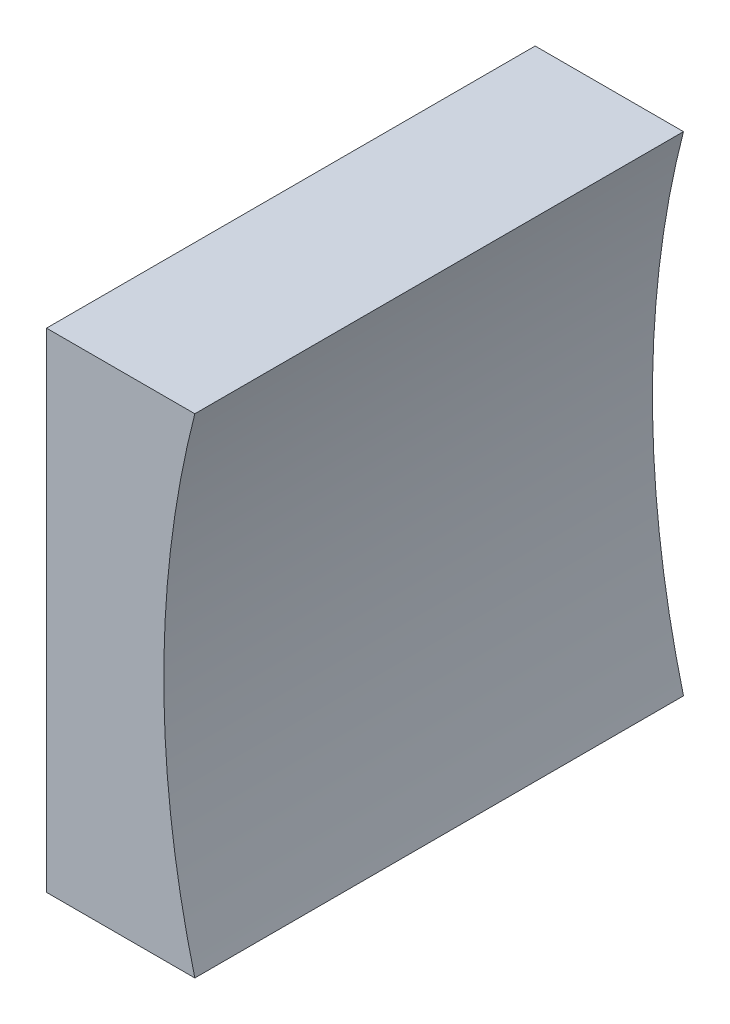
ISO-10303-21;
HEADER;
FILE_DESCRIPTION(('STEP AP214'),'2;1');
FILE_NAME('part.step','',(''),(''),'','','');
FILE_SCHEMA(('AUTOMOTIVE_DESIGN { 1 0 10303 214 1 1 1 1 }'));
ENDSEC;
DATA;
#1=APPLICATION_CONTEXT('core data for automotive mechanical design processes');
#2=APPLICATION_PROTOCOL_DEFINITION('international standard','automotive_design',2000,#1);
#3=PRODUCT_CONTEXT('',#1,'mechanical');
#4=PRODUCT('Part','Part','',(#3));
#5=PRODUCT_RELATED_PRODUCT_CATEGORY('part','',(#4));
#6=PRODUCT_DEFINITION_FORMATION('','',#4);
#7=PRODUCT_DEFINITION_CONTEXT('part definition',#1,'design');
#8=PRODUCT_DEFINITION('design','',#6,#7);
#9=PRODUCT_DEFINITION_SHAPE('','',#8);
#10=(LENGTH_UNIT() NAMED_UNIT(*) SI_UNIT(.MILLI.,.METRE.));
#11=(NAMED_UNIT(*) PLANE_ANGLE_UNIT() SI_UNIT($,.RADIAN.));
#12=(NAMED_UNIT(*) SI_UNIT($,.STERADIAN.) SOLID_ANGLE_UNIT());
#13=UNCERTAINTY_MEASURE_WITH_UNIT(LENGTH_MEASURE(1.E-05),#10,'distance_accuracy_value','');
#14=(GEOMETRIC_REPRESENTATION_CONTEXT(3) GLOBAL_UNCERTAINTY_ASSIGNED_CONTEXT((#13)) GLOBAL_UNIT_ASSIGNED_CONTEXT((#10,
#11,#12)) REPRESENTATION_CONTEXT('',''));
#15=CARTESIAN_POINT('',(0.,0.,0.));
#16=DIRECTION('',(0.,0.,1.));
#17=DIRECTION('',(1.,0.,0.));
#18=AXIS2_PLACEMENT_3D('',#15,#16,#17);
#19=CARTESIAN_POINT('',(146.147421901845,27.1789646338835,12.5));
#20=DIRECTION('',(0.,1.,0.));
#21=DIRECTION('',(-1.,0.,0.));
#22=AXIS2_PLACEMENT_3D('',#19,#20,#21);
#23=PLANE('',#22);
#24=DIRECTION('',(1.,0.,0.));
#25=VECTOR('',#24,1.);
#26=CARTESIAN_POINT('',(146.147421901845,27.1789646338835,0.));
#27=LINE('',#26,#25);
#28=CARTESIAN_POINT('',(142.353567815641,27.1789646338835,0.));
#29=VERTEX_POINT('',#28);
#30=CARTESIAN_POINT('',(146.147421901845,27.1789646338836,0.));
#31=VERTEX_POINT('',#30);
#32=EDGE_CURVE('E91',#29,#31,#27,.T.);
#33=ORIENTED_EDGE('',*,*,#32,.T.);
#34=DIRECTION('',(0.,0.,-1.));
#35=VECTOR('',#34,1.);
#36=CARTESIAN_POINT('',(146.147421901845,27.1789646338836,12.5));
#37=LINE('',#36,#35);
#38=CARTESIAN_POINT('',(146.147421901845,27.1789646338836,12.5));
#39=VERTEX_POINT('',#38);
#40=EDGE_CURVE('E45',#39,#31,#37,.T.);
#41=ORIENTED_EDGE('',*,*,#40,.F.);
#42=DIRECTION('',(1.,0.,0.));
#43=VECTOR('',#42,1.);
#44=CARTESIAN_POINT('',(146.147421901845,27.1789646338835,12.5));
#45=LINE('',#44,#43);
#46=CARTESIAN_POINT('',(142.353567815641,27.1789646338835,12.5));
#47=VERTEX_POINT('',#46);
#48=EDGE_CURVE('E84',#47,#39,#45,.T.);
#49=ORIENTED_EDGE('',*,*,#48,.F.);
#50=DIRECTION('',(0.,0.,-1.));
#51=VECTOR('',#50,1.);
#52=CARTESIAN_POINT('',(142.353567815641,27.1789646338835,12.5));
#53=LINE('',#52,#51);
#54=EDGE_CURVE('E11',#47,#29,#53,.T.);
#55=ORIENTED_EDGE('',*,*,#54,.T.);
#56=EDGE_LOOP('',(#33,#41,#49,#55));
#57=FACE_BOUND('',#56,.T.);
#58=ADVANCED_FACE('F37',(#57),#23,.F.);
#59=CARTESIAN_POINT('',(170.353567815641,33.4289646338835,12.5));
#60=DIRECTION('',(0.,0.,-1.));
#61=DIRECTION('',(-1.,0.,0.));
#62=AXIS2_PLACEMENT_3D('',#59,#60,#61);
#63=CYLINDRICAL_SURFACE('',#62,25.);
#64=CARTESIAN_POINT('',(170.353567815641,33.4289646338835,0.));
#65=DIRECTION('',(0.,0.,-1.));
#66=DIRECTION('',(1.,0.,0.));
#67=AXIS2_PLACEMENT_3D('',#64,#65,#66);
#68=CIRCLE('',#67,25.);
#69=CARTESIAN_POINT('',(146.147421901845,39.6789646338835,0.));
#70=VERTEX_POINT('',#69);
#71=EDGE_CURVE('E71',#31,#70,#68,.T.);
#72=ORIENTED_EDGE('',*,*,#71,.T.);
#73=DIRECTION('',(0.,0.,-1.));
#74=VECTOR('',#73,1.);
#75=CARTESIAN_POINT('',(146.147421901845,39.6789646338835,12.5));
#76=LINE('',#75,#74);
#77=CARTESIAN_POINT('',(146.147421901845,39.6789646338835,12.5));
#78=VERTEX_POINT('',#77);
#79=EDGE_CURVE('E92',#78,#70,#76,.T.);
#80=ORIENTED_EDGE('',*,*,#79,.F.);
#81=CARTESIAN_POINT('',(170.353567815641,33.4289646338835,12.5));
#82=DIRECTION('',(0.,0.,-1.));
#83=DIRECTION('',(1.,0.,0.));
#84=AXIS2_PLACEMENT_3D('',#81,#82,#83);
#85=CIRCLE('',#84,25.);
#86=EDGE_CURVE('E88',#39,#78,#85,.T.);
#87=ORIENTED_EDGE('',*,*,#86,.F.);
#88=ORIENTED_EDGE('',*,*,#40,.T.);
#89=EDGE_LOOP('',(#72,#80,#87,#88));
#90=FACE_BOUND('',#89,.T.);
#91=ADVANCED_FACE('F93',(#90),#63,.F.);
#92=CARTESIAN_POINT('',(142.353567815641,39.6789646338835,12.5));
#93=DIRECTION('',(0.,-1.,0.));
#94=DIRECTION('',(0.,0.,-1.));
#95=AXIS2_PLACEMENT_3D('',#92,#93,#94);
#96=PLANE('',#95);
#97=DIRECTION('',(-1.,0.,0.));
#98=VECTOR('',#97,1.);
#99=CARTESIAN_POINT('',(142.353567815641,39.6789646338835,0.));
#100=LINE('',#99,#98);
#101=CARTESIAN_POINT('',(142.353567815641,39.6789646338835,0.));
#102=VERTEX_POINT('',#101);
#103=EDGE_CURVE('E78',#70,#102,#100,.T.);
#104=ORIENTED_EDGE('',*,*,#103,.T.);
#105=DIRECTION('',(0.,0.,-1.));
#106=VECTOR('',#105,1.);
#107=CARTESIAN_POINT('',(142.353567815641,39.6789646338835,12.5));
#108=LINE('',#107,#106);
#109=CARTESIAN_POINT('',(142.353567815641,39.6789646338835,12.5));
#110=VERTEX_POINT('',#109);
#111=EDGE_CURVE('E97',#110,#102,#108,.T.);
#112=ORIENTED_EDGE('',*,*,#111,.F.);
#113=DIRECTION('',(-1.,0.,0.));
#114=VECTOR('',#113,1.);
#115=CARTESIAN_POINT('',(142.353567815641,39.6789646338835,12.5));
#116=LINE('',#115,#114);
#117=EDGE_CURVE('E95',#78,#110,#116,.T.);
#118=ORIENTED_EDGE('',*,*,#117,.F.);
#119=ORIENTED_EDGE('',*,*,#79,.T.);
#120=EDGE_LOOP('',(#104,#112,#118,#119));
#121=FACE_BOUND('',#120,.T.);
#122=ADVANCED_FACE('F107',(#121),#96,.F.);
#123=CARTESIAN_POINT('',(142.353567815641,33.4289646338835,12.5));
#124=DIRECTION('',(1.,0.,0.));
#125=DIRECTION('',(0.,0.,-1.));
#126=AXIS2_PLACEMENT_3D('',#123,#124,#125);
#127=PLANE('',#126);
#128=DIRECTION('',(0.,-1.,0.));
#129=VECTOR('',#128,1.);
#130=CARTESIAN_POINT('',(142.353567815641,33.4289646338835,0.));
#131=LINE('',#130,#129);
#132=EDGE_CURVE('E104',#102,#29,#131,.T.);
#133=ORIENTED_EDGE('',*,*,#132,.T.);
#134=ORIENTED_EDGE('',*,*,#54,.F.);
#135=DIRECTION('',(0.,-1.,0.));
#136=VECTOR('',#135,1.);
#137=CARTESIAN_POINT('',(142.353567815641,27.1789646338835,12.5));
#138=LINE('',#137,#136);
#139=EDGE_CURVE('E53',#110,#47,#138,.T.);
#140=ORIENTED_EDGE('',*,*,#139,.F.);
#141=ORIENTED_EDGE('',*,*,#111,.T.);
#142=EDGE_LOOP('',(#133,#134,#140,#141));
#143=FACE_BOUND('',#142,.T.);
#144=ADVANCED_FACE('F111',(#143),#127,.F.);
#145=CARTESIAN_POINT('',(170.353567815641,33.4289646338835,12.5));
#146=DIRECTION('',(0.,0.,1.));
#147=DIRECTION('',(1.,0.,0.));
#148=AXIS2_PLACEMENT_3D('',#145,#146,#147);
#149=PLANE('',#148);
#150=ORIENTED_EDGE('',*,*,#139,.T.);
#151=ORIENTED_EDGE('',*,*,#48,.T.);
#152=ORIENTED_EDGE('',*,*,#86,.T.);
#153=ORIENTED_EDGE('',*,*,#117,.T.);
#154=EDGE_LOOP('',(#150,#151,#152,#153));
#155=FACE_BOUND('',#154,.T.);
#156=ADVANCED_FACE('F86',(#155),#149,.T.);
#157=CARTESIAN_POINT('',(170.353567815641,33.4289646338835,0.));
#158=DIRECTION('',(0.,0.,1.));
#159=DIRECTION('',(1.,0.,0.));
#160=AXIS2_PLACEMENT_3D('',#157,#158,#159);
#161=PLANE('',#160);
#162=ORIENTED_EDGE('',*,*,#32,.F.);
#163=ORIENTED_EDGE('',*,*,#132,.F.);
#164=ORIENTED_EDGE('',*,*,#103,.F.);
#165=ORIENTED_EDGE('',*,*,#71,.F.);
#166=EDGE_LOOP('',(#162,#163,#164,#165));
#167=FACE_BOUND('',#166,.T.);
#168=ADVANCED_FACE('F110',(#167),#161,.F.);
#169=CLOSED_SHELL('',(#58,#91,#122,#144,#156,#168));
#170=MANIFOLD_SOLID_BREP('B2',#169);
#171=ADVANCED_BREP_SHAPE_REPRESENTATION('',(#18,#170),#14);
#172=SHAPE_DEFINITION_REPRESENTATION(#9,#171);
ENDSEC;
END-ISO-10303-21;
